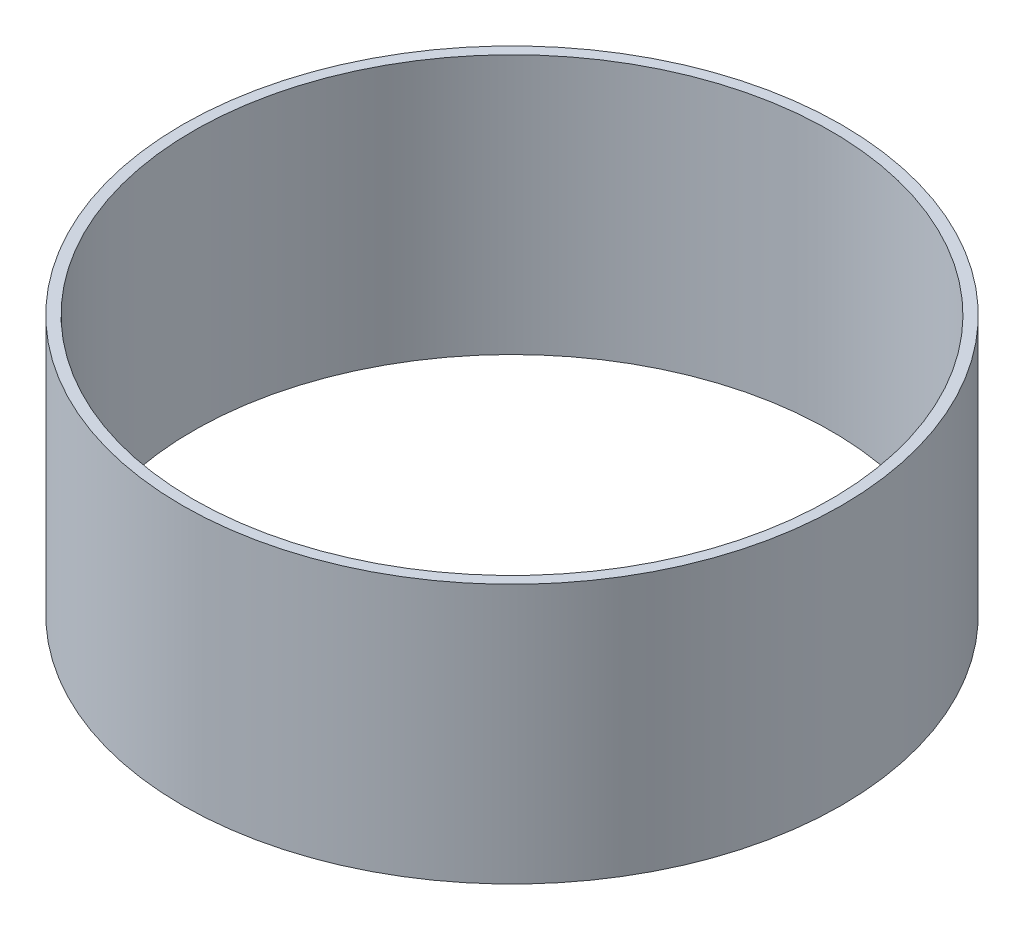
ISO-10303-21;
HEADER;
FILE_DESCRIPTION(('STEP AP214'),'2;1');
FILE_NAME('part.step','',(''),(''),'','','');
FILE_SCHEMA(('AUTOMOTIVE_DESIGN { 1 0 10303 214 1 1 1 1 }'));
ENDSEC;
DATA;
#1=APPLICATION_CONTEXT('core data for automotive mechanical design processes');
#2=APPLICATION_PROTOCOL_DEFINITION('international standard','automotive_design',2000,#1);
#3=PRODUCT_CONTEXT('',#1,'mechanical');
#4=PRODUCT('Part','Part','',(#3));
#5=PRODUCT_RELATED_PRODUCT_CATEGORY('part','',(#4));
#6=PRODUCT_DEFINITION_FORMATION('','',#4);
#7=PRODUCT_DEFINITION_CONTEXT('part definition',#1,'design');
#8=PRODUCT_DEFINITION('design','',#6,#7);
#9=PRODUCT_DEFINITION_SHAPE('','',#8);
#10=(LENGTH_UNIT() NAMED_UNIT(*) SI_UNIT(.MILLI.,.METRE.));
#11=(NAMED_UNIT(*) PLANE_ANGLE_UNIT() SI_UNIT($,.RADIAN.));
#12=(NAMED_UNIT(*) SI_UNIT($,.STERADIAN.) SOLID_ANGLE_UNIT());
#13=UNCERTAINTY_MEASURE_WITH_UNIT(LENGTH_MEASURE(1.E-05),#10,'distance_accuracy_value','');
#14=(GEOMETRIC_REPRESENTATION_CONTEXT(3) GLOBAL_UNCERTAINTY_ASSIGNED_CONTEXT((#13)) GLOBAL_UNIT_ASSIGNED_CONTEXT((#10,
#11,#12)) REPRESENTATION_CONTEXT('',''));
#15=CARTESIAN_POINT('',(0.,0.,0.));
#16=DIRECTION('',(0.,0.,1.));
#17=DIRECTION('',(1.,0.,0.));
#18=AXIS2_PLACEMENT_3D('',#15,#16,#17);
#19=CARTESIAN_POINT('',(0.,120.,0.));
#20=DIRECTION('',(0.,1.,0.));
#21=DIRECTION('',(0.,0.,1.));
#22=AXIS2_PLACEMENT_3D('',#19,#20,#21);
#23=PLANE('',#22);
#24=CARTESIAN_POINT('',(0.,120.,0.));
#25=DIRECTION('',(0.,1.,0.));
#26=DIRECTION('',(0.,0.,1.));
#27=AXIS2_PLACEMENT_3D('',#24,#25,#26);
#28=CIRCLE('',#27,152.4);
#29=CARTESIAN_POINT('',(0.,120.,152.4));
#30=VERTEX_POINT('',#29);
#31=EDGE_CURVE('E10',#30,#30,#28,.T.);
#32=ORIENTED_EDGE('',*,*,#31,.T.);
#33=EDGE_LOOP('',(#32));
#34=FACE_BOUND('',#33,.T.);
#35=CARTESIAN_POINT('',(0.,120.,0.));
#36=DIRECTION('',(0.,1.,0.));
#37=DIRECTION('',(0.,0.,1.));
#38=AXIS2_PLACEMENT_3D('',#35,#36,#37);
#39=CIRCLE('',#38,147.4);
#40=CARTESIAN_POINT('',(0.,120.,147.4));
#41=VERTEX_POINT('',#40);
#42=EDGE_CURVE('E54',#41,#41,#39,.T.);
#43=ORIENTED_EDGE('',*,*,#42,.F.);
#44=EDGE_LOOP('',(#43));
#45=FACE_BOUND('',#44,.T.);
#46=ADVANCED_FACE('F41',(#34,#45),#23,.T.);
#47=CARTESIAN_POINT('',(0.,0.,0.));
#48=DIRECTION('',(0.,1.,0.));
#49=DIRECTION('',(0.,0.,1.));
#50=AXIS2_PLACEMENT_3D('',#47,#48,#49);
#51=PLANE('',#50);
#52=CARTESIAN_POINT('',(0.,0.,0.));
#53=DIRECTION('',(0.,1.,0.));
#54=DIRECTION('',(0.,0.,1.));
#55=AXIS2_PLACEMENT_3D('',#52,#53,#54);
#56=CIRCLE('',#55,152.4);
#57=CARTESIAN_POINT('',(0.,0.,152.4));
#58=VERTEX_POINT('',#57);
#59=EDGE_CURVE('E45',#58,#58,#56,.T.);
#60=ORIENTED_EDGE('',*,*,#59,.F.);
#61=EDGE_LOOP('',(#60));
#62=FACE_BOUND('',#61,.T.);
#63=CARTESIAN_POINT('',(0.,0.,0.));
#64=DIRECTION('',(0.,1.,0.));
#65=DIRECTION('',(0.,0.,1.));
#66=AXIS2_PLACEMENT_3D('',#63,#64,#65);
#67=CIRCLE('',#66,147.4);
#68=CARTESIAN_POINT('',(0.,0.,147.4));
#69=VERTEX_POINT('',#68);
#70=EDGE_CURVE('E56',#69,#69,#67,.T.);
#71=ORIENTED_EDGE('',*,*,#70,.T.);
#72=EDGE_LOOP('',(#71));
#73=FACE_BOUND('',#72,.T.);
#74=ADVANCED_FACE('F68',(#62,#73),#51,.F.);
#75=CARTESIAN_POINT('',(0.,120.,0.));
#76=DIRECTION('',(0.,-1.,0.));
#77=DIRECTION('',(0.,0.,-1.));
#78=AXIS2_PLACEMENT_3D('',#75,#76,#77);
#79=CYLINDRICAL_SURFACE('',#78,152.4);
#80=ORIENTED_EDGE('',*,*,#31,.F.);
#81=EDGE_LOOP('',(#80));
#82=FACE_BOUND('',#81,.T.);
#83=ORIENTED_EDGE('',*,*,#59,.T.);
#84=EDGE_LOOP('',(#83));
#85=FACE_BOUND('',#84,.T.);
#86=ADVANCED_FACE('F43',(#82,#85),#79,.T.);
#87=CARTESIAN_POINT('',(0.,120.,0.));
#88=DIRECTION('',(0.,-1.,0.));
#89=DIRECTION('',(0.,0.,-1.));
#90=AXIS2_PLACEMENT_3D('',#87,#88,#89);
#91=CYLINDRICAL_SURFACE('',#90,147.4);
#92=ORIENTED_EDGE('',*,*,#42,.T.);
#93=EDGE_LOOP('',(#92));
#94=FACE_BOUND('',#93,.T.);
#95=ORIENTED_EDGE('',*,*,#70,.F.);
#96=EDGE_LOOP('',(#95));
#97=FACE_BOUND('',#96,.T.);
#98=ADVANCED_FACE('F64',(#94,#97),#91,.F.);
#99=CLOSED_SHELL('',(#46,#74,#86,#98));
#100=MANIFOLD_SOLID_BREP('B2',#99);
#101=ADVANCED_BREP_SHAPE_REPRESENTATION('',(#18,#100),#14);
#102=SHAPE_DEFINITION_REPRESENTATION(#9,#101);
ENDSEC;
END-ISO-10303-21;
